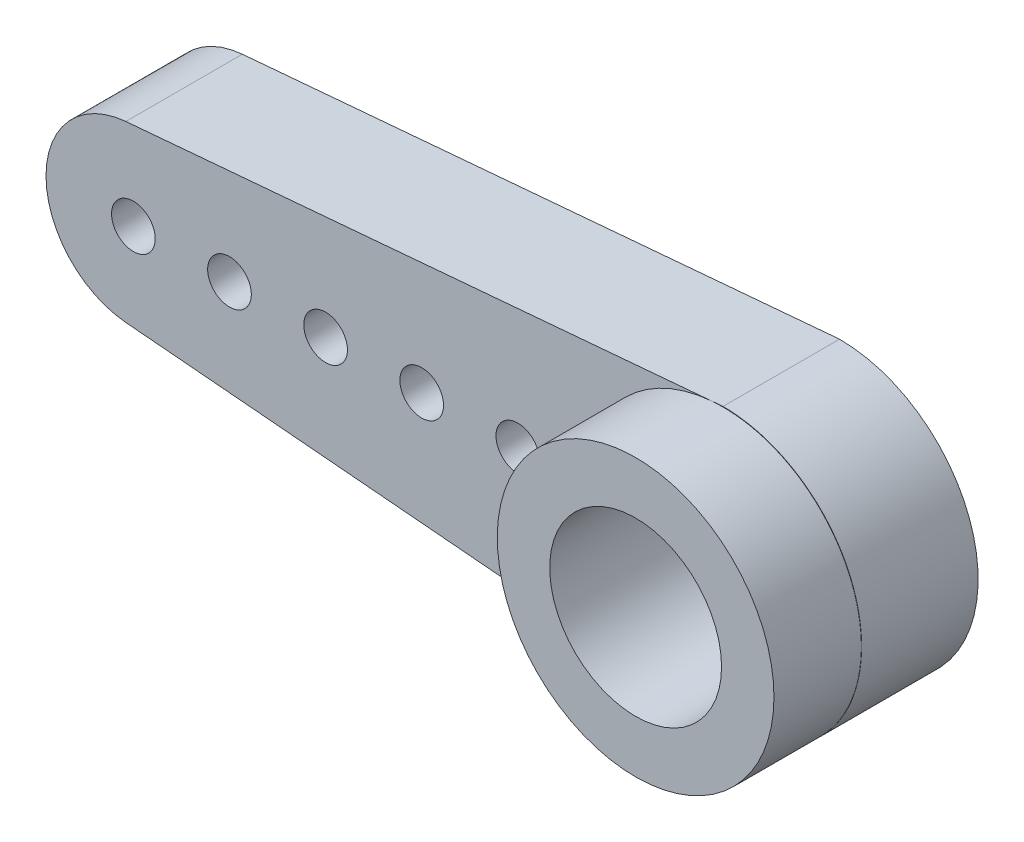
ISO-10303-21;
HEADER;
FILE_DESCRIPTION(('STEP AP214'),'2;1');
FILE_NAME('part.step','',(''),(''),'','','');
FILE_SCHEMA(('AUTOMOTIVE_DESIGN { 1 0 10303 214 1 1 1 1 }'));
ENDSEC;
DATA;
#1=APPLICATION_CONTEXT('core data for automotive mechanical design processes');
#2=APPLICATION_PROTOCOL_DEFINITION('international standard','automotive_design',2000,#1);
#3=PRODUCT_CONTEXT('',#1,'mechanical');
#4=PRODUCT('Part','Part','',(#3));
#5=PRODUCT_RELATED_PRODUCT_CATEGORY('part','',(#4));
#6=PRODUCT_DEFINITION_FORMATION('','',#4);
#7=PRODUCT_DEFINITION_CONTEXT('part definition',#1,'design');
#8=PRODUCT_DEFINITION('design','',#6,#7);
#9=PRODUCT_DEFINITION_SHAPE('','',#8);
#10=(LENGTH_UNIT() NAMED_UNIT(*) SI_UNIT(.MILLI.,.METRE.));
#11=(NAMED_UNIT(*) PLANE_ANGLE_UNIT() SI_UNIT($,.RADIAN.));
#12=(NAMED_UNIT(*) SI_UNIT($,.STERADIAN.) SOLID_ANGLE_UNIT());
#13=UNCERTAINTY_MEASURE_WITH_UNIT(LENGTH_MEASURE(1.E-05),#10,'distance_accuracy_value','');
#14=(GEOMETRIC_REPRESENTATION_CONTEXT(3) GLOBAL_UNCERTAINTY_ASSIGNED_CONTEXT((#13)) GLOBAL_UNIT_ASSIGNED_CONTEXT((#10,
#11,#12)) REPRESENTATION_CONTEXT('',''));
#15=CARTESIAN_POINT('',(0.,0.,0.));
#16=DIRECTION('',(0.,0.,1.));
#17=DIRECTION('',(1.,0.,0.));
#18=AXIS2_PLACEMENT_3D('',#15,#16,#17);
#19=CARTESIAN_POINT('',(0.000772804097320617,0.0089066542155656,4.));
#20=DIRECTION('',(0.,0.,-1.));
#21=DIRECTION('',(-1.,0.,0.));
#22=AXIS2_PLACEMENT_3D('',#19,#20,#21);
#23=PLANE('',#22);
#24=CARTESIAN_POINT('',(0.,0.,4.));
#25=DIRECTION('',(0.,0.,1.));
#26=DIRECTION('',(1.,0.,0.));
#27=AXIS2_PLACEMENT_3D('',#24,#25,#26);
#28=CIRCLE('',#27,4.75);
#29=CARTESIAN_POINT('',(-0.41060076979759,4.73222009292062,4.));
#30=VERTEX_POINT('',#29);
#31=CARTESIAN_POINT('',(-0.410600769797589,-4.73222009292062,4.));
#32=VERTEX_POINT('',#31);
#33=EDGE_CURVE('E47',#30,#32,#28,.T.);
#34=ORIENTED_EDGE('',*,*,#33,.F.);
#35=DIRECTION('',(-0.996256861667499,-0.0864422673258083,0.));
#36=VECTOR('',#35,1.);
#37=CARTESIAN_POINT('',(0.,4.76784670978288,4.));
#38=LINE('',#37,#36);
#39=CARTESIAN_POINT('',(-20.504052607284,2.9887705850025,4.));
#40=VERTEX_POINT('',#39);
#41=EDGE_CURVE('E94',#30,#40,#38,.T.);
#42=ORIENTED_EDGE('',*,*,#41,.T.);
#43=CARTESIAN_POINT('',(-20.2447258053066,0.,4.));
#44=DIRECTION('',(0.,0.,1.));
#45=DIRECTION('',(1.,0.,0.));
#46=AXIS2_PLACEMENT_3D('',#43,#44,#45);
#47=CIRCLE('',#46,3.);
#48=CARTESIAN_POINT('',(-20.504052607284,-2.9887705850025,4.));
#49=VERTEX_POINT('',#48);
#50=EDGE_CURVE('E93',#40,#49,#47,.T.);
#51=ORIENTED_EDGE('',*,*,#50,.T.);
#52=DIRECTION('',(0.996256861667498,-0.0864422673258083,0.));
#53=VECTOR('',#52,1.);
#54=CARTESIAN_POINT('',(-20.504052607284,-2.9887705850025,4.));
#55=LINE('',#54,#53);
#56=EDGE_CURVE('E105',#49,#32,#55,.T.);
#57=ORIENTED_EDGE('',*,*,#56,.T.);
#58=EDGE_LOOP('',(#34,#42,#51,#57));
#59=FACE_BOUND('',#58,.T.);
#60=CARTESIAN_POINT('',(-16.9447258053066,0.,4.));
#61=DIRECTION('',(0.,0.,1.));
#62=DIRECTION('',(1.,0.,0.));
#63=AXIS2_PLACEMENT_3D('',#60,#61,#62);
#64=CIRCLE('',#63,0.750000000000002);
#65=CARTESIAN_POINT('',(-16.1947258053066,0.,4.));
#66=VERTEX_POINT('',#65);
#67=EDGE_CURVE('E158',#66,#66,#64,.T.);
#68=ORIENTED_EDGE('',*,*,#67,.F.);
#69=EDGE_LOOP('',(#68));
#70=FACE_BOUND('',#69,.T.);
#71=CARTESIAN_POINT('',(-13.6447258053066,0.,4.));
#72=DIRECTION('',(0.,0.,1.));
#73=DIRECTION('',(1.,0.,0.));
#74=AXIS2_PLACEMENT_3D('',#71,#72,#73);
#75=CIRCLE('',#74,0.750000000000002);
#76=CARTESIAN_POINT('',(-12.8947258053066,0.,4.));
#77=VERTEX_POINT('',#76);
#78=EDGE_CURVE('E198',#77,#77,#75,.T.);
#79=ORIENTED_EDGE('',*,*,#78,.F.);
#80=EDGE_LOOP('',(#79));
#81=FACE_BOUND('',#80,.T.);
#82=CARTESIAN_POINT('',(-20.2447258053066,0.,4.));
#83=DIRECTION('',(0.,0.,1.));
#84=DIRECTION('',(1.,0.,0.));
#85=AXIS2_PLACEMENT_3D('',#82,#83,#84);
#86=CIRCLE('',#85,0.750000000000002);
#87=CARTESIAN_POINT('',(-19.4947258053066,0.,4.));
#88=VERTEX_POINT('',#87);
#89=EDGE_CURVE('E193',#88,#88,#86,.T.);
#90=ORIENTED_EDGE('',*,*,#89,.F.);
#91=EDGE_LOOP('',(#90));
#92=FACE_BOUND('',#91,.T.);
#93=CARTESIAN_POINT('',(-10.3447258053066,0.,4.));
#94=DIRECTION('',(0.,0.,1.));
#95=DIRECTION('',(1.,0.,0.));
#96=AXIS2_PLACEMENT_3D('',#93,#94,#95);
#97=CIRCLE('',#96,0.750000000000002);
#98=CARTESIAN_POINT('',(-9.59472580530658,0.,4.));
#99=VERTEX_POINT('',#98);
#100=EDGE_CURVE('E188',#99,#99,#97,.T.);
#101=ORIENTED_EDGE('',*,*,#100,.F.);
#102=EDGE_LOOP('',(#101));
#103=FACE_BOUND('',#102,.T.);
#104=CARTESIAN_POINT('',(-7.04472580530658,0.,4.));
#105=DIRECTION('',(0.,0.,1.));
#106=DIRECTION('',(1.,0.,0.));
#107=AXIS2_PLACEMENT_3D('',#104,#105,#106);
#108=CIRCLE('',#107,0.750000000000002);
#109=CARTESIAN_POINT('',(-6.29472580530657,0.,4.));
#110=VERTEX_POINT('',#109);
#111=EDGE_CURVE('E180',#110,#110,#108,.T.);
#112=ORIENTED_EDGE('',*,*,#111,.F.);
#113=EDGE_LOOP('',(#112));
#114=FACE_BOUND('',#113,.T.);
#115=ADVANCED_FACE('F36',(#59,#70,#81,#92,#103,#114),#23,.F.);
#116=EDGE_CURVE('E11',#32,#30,#28,.T.);
#117=ORIENTED_EDGE('',*,*,#116,.F.);
#118=CARTESIAN_POINT('',(0.000772804097320617,0.0089066542155656,4.));
#119=DIRECTION('',(0.,0.,1.));
#120=DIRECTION('',(-1.,0.,0.));
#121=AXIS2_PLACEMENT_3D('',#118,#119,#120);
#122=CIRCLE('',#121,4.75894011831513);
#123=CARTESIAN_POINT('',(0.,4.76784670978288,4.));
#124=VERTEX_POINT('',#123);
#125=EDGE_CURVE('E91',#32,#124,#122,.T.);
#126=ORIENTED_EDGE('',*,*,#125,.T.);
#127=EDGE_CURVE('E86',#124,#30,#38,.T.);
#128=ORIENTED_EDGE('',*,*,#127,.T.);
#129=EDGE_LOOP('',(#117,#126,#128));
#130=FACE_BOUND('',#129,.T.);
#131=ADVANCED_FACE('F89',(#130),#23,.F.);
#132=CARTESIAN_POINT('',(0.000772804097320617,0.0089066542155656,0.));
#133=DIRECTION('',(0.,0.,-1.));
#134=DIRECTION('',(-1.,0.,0.));
#135=AXIS2_PLACEMENT_3D('',#132,#133,#134);
#136=PLANE('',#135);
#137=CARTESIAN_POINT('',(-10.3447258053066,0.,0.));
#138=DIRECTION('',(0.,0.,1.));
#139=DIRECTION('',(1.,0.,0.));
#140=AXIS2_PLACEMENT_3D('',#137,#138,#139);
#141=CIRCLE('',#140,0.750000000000002);
#142=CARTESIAN_POINT('',(-9.59472580530658,0.,0.));
#143=VERTEX_POINT('',#142);
#144=EDGE_CURVE('E183',#143,#143,#141,.T.);
#145=ORIENTED_EDGE('',*,*,#144,.T.);
#146=EDGE_LOOP('',(#145));
#147=FACE_BOUND('',#146,.T.);
#148=CARTESIAN_POINT('',(-13.6447258053066,0.,0.));
#149=DIRECTION('',(0.,0.,1.));
#150=DIRECTION('',(1.,0.,0.));
#151=AXIS2_PLACEMENT_3D('',#148,#149,#150);
#152=CIRCLE('',#151,0.750000000000002);
#153=CARTESIAN_POINT('',(-12.8947258053066,0.,0.));
#154=VERTEX_POINT('',#153);
#155=EDGE_CURVE('E196',#154,#154,#152,.T.);
#156=ORIENTED_EDGE('',*,*,#155,.T.);
#157=EDGE_LOOP('',(#156));
#158=FACE_BOUND('',#157,.T.);
#159=CARTESIAN_POINT('',(0.,0.,0.));
#160=DIRECTION('',(0.,0.,1.));
#161=DIRECTION('',(1.,0.,0.));
#162=AXIS2_PLACEMENT_3D('',#159,#160,#161);
#163=CIRCLE('',#162,2.95);
#164=CARTESIAN_POINT('',(2.95,0.,0.));
#165=VERTEX_POINT('',#164);
#166=EDGE_CURVE('E154',#165,#165,#163,.T.);
#167=ORIENTED_EDGE('',*,*,#166,.T.);
#168=EDGE_LOOP('',(#167));
#169=FACE_BOUND('',#168,.T.);
#170=CARTESIAN_POINT('',(0.000772804097320617,0.0089066542155656,0.));
#171=DIRECTION('',(0.,0.,1.));
#172=DIRECTION('',(-1.,0.,0.));
#173=AXIS2_PLACEMENT_3D('',#170,#171,#172);
#174=CIRCLE('',#173,4.75894011831513);
#175=CARTESIAN_POINT('',(-0.410600769797589,-4.73222009292062,0.));
#176=VERTEX_POINT('',#175);
#177=CARTESIAN_POINT('',(0.,4.76784670978288,0.));
#178=VERTEX_POINT('',#177);
#179=EDGE_CURVE('E150',#176,#178,#174,.T.);
#180=ORIENTED_EDGE('',*,*,#179,.F.);
#181=DIRECTION('',(0.996256861667498,-0.0864422673258083,0.));
#182=VECTOR('',#181,1.);
#183=CARTESIAN_POINT('',(-20.504052607284,-2.9887705850025,0.));
#184=LINE('',#183,#182);
#185=CARTESIAN_POINT('',(-20.504052607284,-2.9887705850025,0.));
#186=VERTEX_POINT('',#185);
#187=EDGE_CURVE('E79',#186,#176,#184,.T.);
#188=ORIENTED_EDGE('',*,*,#187,.F.);
#189=CARTESIAN_POINT('',(-20.2447258053066,0.,0.));
#190=DIRECTION('',(0.,0.,1.));
#191=DIRECTION('',(1.,0.,0.));
#192=AXIS2_PLACEMENT_3D('',#189,#190,#191);
#193=CIRCLE('',#192,3.);
#194=CARTESIAN_POINT('',(-20.504052607284,2.9887705850025,0.));
#195=VERTEX_POINT('',#194);
#196=EDGE_CURVE('E72',#195,#186,#193,.T.);
#197=ORIENTED_EDGE('',*,*,#196,.F.);
#198=DIRECTION('',(-0.996256861667499,-0.0864422673258083,0.));
#199=VECTOR('',#198,1.);
#200=CARTESIAN_POINT('',(0.,4.76784670978288,0.));
#201=LINE('',#200,#199);
#202=EDGE_CURVE('E153',#178,#195,#201,.T.);
#203=ORIENTED_EDGE('',*,*,#202,.F.);
#204=EDGE_LOOP('',(#180,#188,#197,#203));
#205=FACE_BOUND('',#204,.T.);
#206=CARTESIAN_POINT('',(-16.9447258053066,0.,0.));
#207=DIRECTION('',(0.,0.,1.));
#208=DIRECTION('',(1.,0.,0.));
#209=AXIS2_PLACEMENT_3D('',#206,#207,#208);
#210=CIRCLE('',#209,0.750000000000002);
#211=CARTESIAN_POINT('',(-16.1947258053066,0.,0.));
#212=VERTEX_POINT('',#211);
#213=EDGE_CURVE('E171',#212,#212,#210,.T.);
#214=ORIENTED_EDGE('',*,*,#213,.T.);
#215=EDGE_LOOP('',(#214));
#216=FACE_BOUND('',#215,.T.);
#217=CARTESIAN_POINT('',(-20.2447258053066,0.,0.));
#218=DIRECTION('',(0.,0.,1.));
#219=DIRECTION('',(1.,0.,0.));
#220=AXIS2_PLACEMENT_3D('',#217,#218,#219);
#221=CIRCLE('',#220,0.750000000000002);
#222=CARTESIAN_POINT('',(-19.4947258053066,0.,0.));
#223=VERTEX_POINT('',#222);
#224=EDGE_CURVE('E175',#223,#223,#221,.T.);
#225=ORIENTED_EDGE('',*,*,#224,.T.);
#226=EDGE_LOOP('',(#225));
#227=FACE_BOUND('',#226,.T.);
#228=CARTESIAN_POINT('',(-7.04472580530658,0.,0.));
#229=DIRECTION('',(0.,0.,1.));
#230=DIRECTION('',(1.,0.,0.));
#231=AXIS2_PLACEMENT_3D('',#228,#229,#230);
#232=CIRCLE('',#231,0.750000000000002);
#233=CARTESIAN_POINT('',(-6.29472580530657,0.,0.));
#234=VERTEX_POINT('',#233);
#235=EDGE_CURVE('E178',#234,#234,#232,.T.);
#236=ORIENTED_EDGE('',*,*,#235,.T.);
#237=EDGE_LOOP('',(#236));
#238=FACE_BOUND('',#237,.T.);
#239=ADVANCED_FACE('F128',(#147,#158,#169,#205,#216,#227,#238),#136,.T.);
#240=CARTESIAN_POINT('',(0.000772804097320617,0.0089066542155656,4.));
#241=DIRECTION('',(0.,0.,-1.));
#242=DIRECTION('',(-1.,0.,0.));
#243=AXIS2_PLACEMENT_3D('',#240,#241,#242);
#244=CYLINDRICAL_SURFACE('',#243,4.75894011831513);
#245=ORIENTED_EDGE('',*,*,#179,.T.);
#246=DIRECTION('',(0.,0.,-1.));
#247=VECTOR('',#246,1.);
#248=CARTESIAN_POINT('',(0.,4.76784670978288,4.));
#249=LINE('',#248,#247);
#250=EDGE_CURVE('E40',#124,#178,#249,.T.);
#251=ORIENTED_EDGE('',*,*,#250,.F.);
#252=ORIENTED_EDGE('',*,*,#125,.F.);
#253=DIRECTION('',(0.,0.,-1.));
#254=VECTOR('',#253,1.);
#255=CARTESIAN_POINT('',(-0.410600769797589,-4.73222009292062,4.));
#256=LINE('',#255,#254);
#257=EDGE_CURVE('E151',#32,#176,#256,.T.);
#258=ORIENTED_EDGE('',*,*,#257,.T.);
#259=EDGE_LOOP('',(#245,#251,#252,#258));
#260=FACE_BOUND('',#259,.T.);
#261=ADVANCED_FACE('F38',(#260),#244,.T.);
#262=CARTESIAN_POINT('',(0.,4.76784670978288,4.));
#263=DIRECTION('',(0.0864422673258083,-0.996256861667499,0.));
#264=DIRECTION('',(0.996256861667499,0.0864422673258083,0.));
#265=AXIS2_PLACEMENT_3D('',#262,#263,#264);
#266=PLANE('',#265);
#267=ORIENTED_EDGE('',*,*,#202,.T.);
#268=DIRECTION('',(0.,0.,-1.));
#269=VECTOR('',#268,1.);
#270=CARTESIAN_POINT('',(-20.504052607284,2.9887705850025,4.));
#271=LINE('',#270,#269);
#272=EDGE_CURVE('E99',#40,#195,#271,.T.);
#273=ORIENTED_EDGE('',*,*,#272,.F.);
#274=ORIENTED_EDGE('',*,*,#41,.F.);
#275=ORIENTED_EDGE('',*,*,#127,.F.);
#276=ORIENTED_EDGE('',*,*,#250,.T.);
#277=EDGE_LOOP('',(#267,#273,#274,#275,#276));
#278=FACE_BOUND('',#277,.T.);
#279=ADVANCED_FACE('F98',(#278),#266,.F.);
#280=CARTESIAN_POINT('',(-20.2447258053066,0.,4.));
#281=DIRECTION('',(0.,0.,-1.));
#282=DIRECTION('',(-1.,0.,0.));
#283=AXIS2_PLACEMENT_3D('',#280,#281,#282);
#284=CYLINDRICAL_SURFACE('',#283,3.);
#285=ORIENTED_EDGE('',*,*,#196,.T.);
#286=DIRECTION('',(0.,0.,-1.));
#287=VECTOR('',#286,1.);
#288=CARTESIAN_POINT('',(-20.504052607284,-2.9887705850025,4.));
#289=LINE('',#288,#287);
#290=EDGE_CURVE('E166',#49,#186,#289,.T.);
#291=ORIENTED_EDGE('',*,*,#290,.F.);
#292=ORIENTED_EDGE('',*,*,#50,.F.);
#293=ORIENTED_EDGE('',*,*,#272,.T.);
#294=EDGE_LOOP('',(#285,#291,#292,#293));
#295=FACE_BOUND('',#294,.T.);
#296=ADVANCED_FACE('F139',(#295),#284,.T.);
#297=CARTESIAN_POINT('',(-20.504052607284,-2.9887705850025,4.));
#298=DIRECTION('',(0.0864422673258083,0.996256861667499,0.));
#299=DIRECTION('',(-0.996256861667499,0.0864422673258083,0.));
#300=AXIS2_PLACEMENT_3D('',#297,#298,#299);
#301=PLANE('',#300);
#302=ORIENTED_EDGE('',*,*,#187,.T.);
#303=ORIENTED_EDGE('',*,*,#257,.F.);
#304=ORIENTED_EDGE('',*,*,#56,.F.);
#305=ORIENTED_EDGE('',*,*,#290,.T.);
#306=EDGE_LOOP('',(#302,#303,#304,#305));
#307=FACE_BOUND('',#306,.T.);
#308=ADVANCED_FACE('F136',(#307),#301,.F.);
#309=CARTESIAN_POINT('',(0.,0.,4.));
#310=DIRECTION('',(0.,0.,-1.));
#311=DIRECTION('',(-1.,0.,0.));
#312=AXIS2_PLACEMENT_3D('',#309,#310,#311);
#313=CYLINDRICAL_SURFACE('',#312,2.95);
#314=ORIENTED_EDGE('',*,*,#166,.F.);
#315=EDGE_LOOP('',(#314));
#316=FACE_BOUND('',#315,.T.);
#317=CARTESIAN_POINT('',(0.,0.,7.));
#318=DIRECTION('',(0.,0.,1.));
#319=DIRECTION('',(1.,0.,0.));
#320=AXIS2_PLACEMENT_3D('',#317,#318,#319);
#321=CIRCLE('',#320,2.95);
#322=CARTESIAN_POINT('',(2.95,0.,7.));
#323=VERTEX_POINT('',#322);
#324=EDGE_CURVE('E108',#323,#323,#321,.T.);
#325=ORIENTED_EDGE('',*,*,#324,.T.);
#326=EDGE_LOOP('',(#325));
#327=FACE_BOUND('',#326,.T.);
#328=ADVANCED_FACE('F131',(#316,#327),#313,.F.);
#329=CARTESIAN_POINT('',(-16.9447258053066,0.,4.));
#330=DIRECTION('',(0.,0.,-1.));
#331=DIRECTION('',(-1.,0.,0.));
#332=AXIS2_PLACEMENT_3D('',#329,#330,#331);
#333=CYLINDRICAL_SURFACE('',#332,0.750000000000002);
#334=ORIENTED_EDGE('',*,*,#67,.T.);
#335=EDGE_LOOP('',(#334));
#336=FACE_BOUND('',#335,.T.);
#337=ORIENTED_EDGE('',*,*,#213,.F.);
#338=EDGE_LOOP('',(#337));
#339=FACE_BOUND('',#338,.T.);
#340=ADVANCED_FACE('F208',(#336,#339),#333,.F.);
#341=CARTESIAN_POINT('',(-13.6447258053066,0.,4.));
#342=DIRECTION('',(0.,0.,-1.));
#343=DIRECTION('',(-1.,0.,0.));
#344=AXIS2_PLACEMENT_3D('',#341,#342,#343);
#345=CYLINDRICAL_SURFACE('',#344,0.750000000000002);
#346=ORIENTED_EDGE('',*,*,#78,.T.);
#347=EDGE_LOOP('',(#346));
#348=FACE_BOUND('',#347,.T.);
#349=ORIENTED_EDGE('',*,*,#155,.F.);
#350=EDGE_LOOP('',(#349));
#351=FACE_BOUND('',#350,.T.);
#352=ADVANCED_FACE('F229',(#348,#351),#345,.F.);
#353=CARTESIAN_POINT('',(-20.2447258053066,0.,4.));
#354=DIRECTION('',(0.,0.,-1.));
#355=DIRECTION('',(-1.,0.,0.));
#356=AXIS2_PLACEMENT_3D('',#353,#354,#355);
#357=CYLINDRICAL_SURFACE('',#356,0.750000000000002);
#358=ORIENTED_EDGE('',*,*,#89,.T.);
#359=EDGE_LOOP('',(#358));
#360=FACE_BOUND('',#359,.T.);
#361=ORIENTED_EDGE('',*,*,#224,.F.);
#362=EDGE_LOOP('',(#361));
#363=FACE_BOUND('',#362,.T.);
#364=ADVANCED_FACE('F223',(#360,#363),#357,.F.);
#365=CARTESIAN_POINT('',(-10.3447258053066,0.,4.));
#366=DIRECTION('',(0.,0.,-1.));
#367=DIRECTION('',(-1.,0.,0.));
#368=AXIS2_PLACEMENT_3D('',#365,#366,#367);
#369=CYLINDRICAL_SURFACE('',#368,0.750000000000002);
#370=ORIENTED_EDGE('',*,*,#100,.T.);
#371=EDGE_LOOP('',(#370));
#372=FACE_BOUND('',#371,.T.);
#373=ORIENTED_EDGE('',*,*,#144,.F.);
#374=EDGE_LOOP('',(#373));
#375=FACE_BOUND('',#374,.T.);
#376=ADVANCED_FACE('F219',(#372,#375),#369,.F.);
#377=CARTESIAN_POINT('',(-7.04472580530658,0.,4.));
#378=DIRECTION('',(0.,0.,-1.));
#379=DIRECTION('',(-1.,0.,0.));
#380=AXIS2_PLACEMENT_3D('',#377,#378,#379);
#381=CYLINDRICAL_SURFACE('',#380,0.750000000000002);
#382=ORIENTED_EDGE('',*,*,#111,.T.);
#383=EDGE_LOOP('',(#382));
#384=FACE_BOUND('',#383,.T.);
#385=ORIENTED_EDGE('',*,*,#235,.F.);
#386=EDGE_LOOP('',(#385));
#387=FACE_BOUND('',#386,.T.);
#388=ADVANCED_FACE('F117',(#384,#387),#381,.F.);
#389=CARTESIAN_POINT('',(0.,0.,7.));
#390=DIRECTION('',(0.,0.,1.));
#391=DIRECTION('',(1.,0.,0.));
#392=AXIS2_PLACEMENT_3D('',#389,#390,#391);
#393=PLANE('',#392);
#394=CARTESIAN_POINT('',(0.,0.,7.));
#395=DIRECTION('',(0.,0.,1.));
#396=DIRECTION('',(1.,0.,0.));
#397=AXIS2_PLACEMENT_3D('',#394,#395,#396);
#398=CIRCLE('',#397,4.75);
#399=CARTESIAN_POINT('',(4.75,0.,7.));
#400=VERTEX_POINT('',#399);
#401=EDGE_CURVE('E107',#400,#400,#398,.T.);
#402=ORIENTED_EDGE('',*,*,#401,.T.);
#403=EDGE_LOOP('',(#402));
#404=FACE_BOUND('',#403,.T.);
#405=ORIENTED_EDGE('',*,*,#324,.F.);
#406=EDGE_LOOP('',(#405));
#407=FACE_BOUND('',#406,.T.);
#408=ADVANCED_FACE('F111',(#404,#407),#393,.T.);
#409=CARTESIAN_POINT('',(0.,0.,7.));
#410=DIRECTION('',(0.,0.,-1.));
#411=DIRECTION('',(-1.,0.,0.));
#412=AXIS2_PLACEMENT_3D('',#409,#410,#411);
#413=CYLINDRICAL_SURFACE('',#412,4.75);
#414=ORIENTED_EDGE('',*,*,#401,.F.);
#415=EDGE_LOOP('',(#414));
#416=FACE_BOUND('',#415,.T.);
#417=ORIENTED_EDGE('',*,*,#33,.T.);
#418=ORIENTED_EDGE('',*,*,#116,.T.);
#419=EDGE_LOOP('',(#417,#418));
#420=FACE_BOUND('',#419,.T.);
#421=ADVANCED_FACE('F109',(#416,#420),#413,.T.);
#422=CLOSED_SHELL('',(#115,#131,#239,#261,#279,#296,#308,#328,#340,#352,#364,#376,#388,#408,#421));
#423=MANIFOLD_SOLID_BREP('B2',#422);
#424=ADVANCED_BREP_SHAPE_REPRESENTATION('',(#18,#423),#14);
#425=SHAPE_DEFINITION_REPRESENTATION(#9,#424);
ENDSEC;
END-ISO-10303-21;
